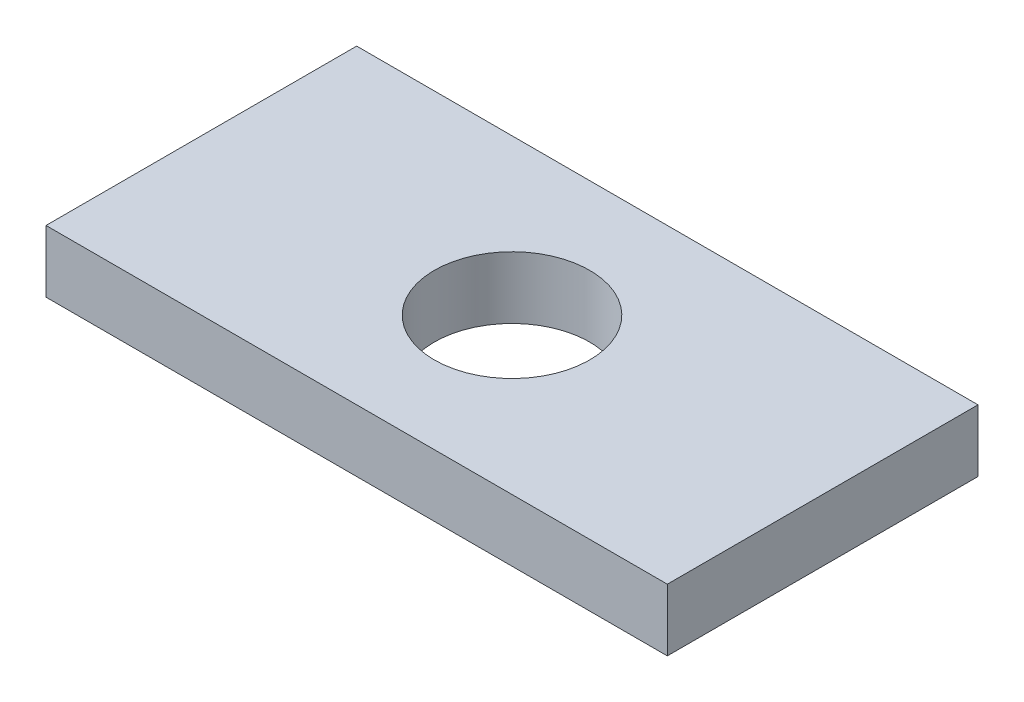
ISO-10303-21;
HEADER;
FILE_DESCRIPTION(('STEP AP214'),'2;1');
FILE_NAME('part.step','',(''),(''),'','','');
FILE_SCHEMA(('AUTOMOTIVE_DESIGN { 1 0 10303 214 1 1 1 1 }'));
ENDSEC;
DATA;
#1=APPLICATION_CONTEXT('core data for automotive mechanical design processes');
#2=APPLICATION_PROTOCOL_DEFINITION('international standard','automotive_design',2000,#1);
#3=PRODUCT_CONTEXT('',#1,'mechanical');
#4=PRODUCT('Part','Part','',(#3));
#5=PRODUCT_RELATED_PRODUCT_CATEGORY('part','',(#4));
#6=PRODUCT_DEFINITION_FORMATION('','',#4);
#7=PRODUCT_DEFINITION_CONTEXT('part definition',#1,'design');
#8=PRODUCT_DEFINITION('design','',#6,#7);
#9=PRODUCT_DEFINITION_SHAPE('','',#8);
#10=(LENGTH_UNIT() NAMED_UNIT(*) SI_UNIT(.MILLI.,.METRE.));
#11=(NAMED_UNIT(*) PLANE_ANGLE_UNIT() SI_UNIT($,.RADIAN.));
#12=(NAMED_UNIT(*) SI_UNIT($,.STERADIAN.) SOLID_ANGLE_UNIT());
#13=UNCERTAINTY_MEASURE_WITH_UNIT(LENGTH_MEASURE(1.E-05),#10,'distance_accuracy_value','');
#14=(GEOMETRIC_REPRESENTATION_CONTEXT(3) GLOBAL_UNCERTAINTY_ASSIGNED_CONTEXT((#13)) GLOBAL_UNIT_ASSIGNED_CONTEXT((#10,
#11,#12)) REPRESENTATION_CONTEXT('',''));
#15=CARTESIAN_POINT('',(0.,0.,0.));
#16=DIRECTION('',(0.,0.,1.));
#17=DIRECTION('',(1.,0.,0.));
#18=AXIS2_PLACEMENT_3D('',#15,#16,#17);
#19=CARTESIAN_POINT('',(0.,4.,0.));
#20=DIRECTION('',(1.,0.,0.));
#21=DIRECTION('',(0.,0.,-1.));
#22=AXIS2_PLACEMENT_3D('',#19,#20,#21);
#23=PLANE('',#22);
#24=DIRECTION('',(0.,0.,1.));
#25=VECTOR('',#24,1.);
#26=CARTESIAN_POINT('',(0.,0.,0.));
#27=LINE('',#26,#25);
#28=CARTESIAN_POINT('',(0.,0.,-20.));
#29=VERTEX_POINT('',#28);
#30=CARTESIAN_POINT('',(0.,0.,0.));
#31=VERTEX_POINT('',#30);
#32=EDGE_CURVE('E97',#29,#31,#27,.T.);
#33=ORIENTED_EDGE('',*,*,#32,.T.);
#34=DIRECTION('',(0.,-1.,0.));
#35=VECTOR('',#34,1.);
#36=CARTESIAN_POINT('',(0.,4.,0.));
#37=LINE('',#36,#35);
#38=CARTESIAN_POINT('',(0.,4.,0.));
#39=VERTEX_POINT('',#38);
#40=EDGE_CURVE('E11',#39,#31,#37,.T.);
#41=ORIENTED_EDGE('',*,*,#40,.F.);
#42=DIRECTION('',(0.,0.,1.));
#43=VECTOR('',#42,1.);
#44=CARTESIAN_POINT('',(0.,4.,0.));
#45=LINE('',#44,#43);
#46=CARTESIAN_POINT('',(0.,4.,-20.));
#47=VERTEX_POINT('',#46);
#48=EDGE_CURVE('E85',#47,#39,#45,.T.);
#49=ORIENTED_EDGE('',*,*,#48,.F.);
#50=DIRECTION('',(0.,-1.,0.));
#51=VECTOR('',#50,1.);
#52=CARTESIAN_POINT('',(0.,4.,-20.));
#53=LINE('',#52,#51);
#54=EDGE_CURVE('E93',#47,#29,#53,.T.);
#55=ORIENTED_EDGE('',*,*,#54,.T.);
#56=EDGE_LOOP('',(#33,#41,#49,#55));
#57=FACE_BOUND('',#56,.T.);
#58=ADVANCED_FACE('F34',(#57),#23,.F.);
#59=CARTESIAN_POINT('',(0.,4.,0.));
#60=DIRECTION('',(0.,0.,-1.));
#61=DIRECTION('',(-1.,0.,0.));
#62=AXIS2_PLACEMENT_3D('',#59,#60,#61);
#63=PLANE('',#62);
#64=DIRECTION('',(1.,0.,0.));
#65=VECTOR('',#64,1.);
#66=CARTESIAN_POINT('',(0.,0.,0.));
#67=LINE('',#66,#65);
#68=CARTESIAN_POINT('',(40.,0.,0.));
#69=VERTEX_POINT('',#68);
#70=EDGE_CURVE('E89',#31,#69,#67,.T.);
#71=ORIENTED_EDGE('',*,*,#70,.T.);
#72=DIRECTION('',(0.,-1.,0.));
#73=VECTOR('',#72,1.);
#74=CARTESIAN_POINT('',(40.,4.,0.));
#75=LINE('',#74,#73);
#76=CARTESIAN_POINT('',(40.,4.,0.));
#77=VERTEX_POINT('',#76);
#78=EDGE_CURVE('E42',#77,#69,#75,.T.);
#79=ORIENTED_EDGE('',*,*,#78,.F.);
#80=DIRECTION('',(1.,0.,0.));
#81=VECTOR('',#80,1.);
#82=CARTESIAN_POINT('',(0.,4.,0.));
#83=LINE('',#82,#81);
#84=EDGE_CURVE('E80',#39,#77,#83,.T.);
#85=ORIENTED_EDGE('',*,*,#84,.F.);
#86=ORIENTED_EDGE('',*,*,#40,.T.);
#87=EDGE_LOOP('',(#71,#79,#85,#86));
#88=FACE_BOUND('',#87,.T.);
#89=ADVANCED_FACE('F88',(#88),#63,.F.);
#90=CARTESIAN_POINT('',(40.,4.,0.));
#91=DIRECTION('',(-1.,0.,0.));
#92=DIRECTION('',(0.,0.,1.));
#93=AXIS2_PLACEMENT_3D('',#90,#91,#92);
#94=PLANE('',#93);
#95=DIRECTION('',(0.,0.,-1.));
#96=VECTOR('',#95,1.);
#97=CARTESIAN_POINT('',(40.,0.,0.));
#98=LINE('',#97,#96);
#99=CARTESIAN_POINT('',(40.,0.,-20.));
#100=VERTEX_POINT('',#99);
#101=EDGE_CURVE('E67',#69,#100,#98,.T.);
#102=ORIENTED_EDGE('',*,*,#101,.T.);
#103=DIRECTION('',(0.,-1.,0.));
#104=VECTOR('',#103,1.);
#105=CARTESIAN_POINT('',(40.,4.,-20.));
#106=LINE('',#105,#104);
#107=CARTESIAN_POINT('',(40.,4.,-20.));
#108=VERTEX_POINT('',#107);
#109=EDGE_CURVE('E90',#108,#100,#106,.T.);
#110=ORIENTED_EDGE('',*,*,#109,.F.);
#111=DIRECTION('',(0.,0.,-1.));
#112=VECTOR('',#111,1.);
#113=CARTESIAN_POINT('',(40.,4.,0.));
#114=LINE('',#113,#112);
#115=EDGE_CURVE('E83',#77,#108,#114,.T.);
#116=ORIENTED_EDGE('',*,*,#115,.F.);
#117=ORIENTED_EDGE('',*,*,#78,.T.);
#118=EDGE_LOOP('',(#102,#110,#116,#117));
#119=FACE_BOUND('',#118,.T.);
#120=ADVANCED_FACE('F91',(#119),#94,.F.);
#121=CARTESIAN_POINT('',(0.,4.,-20.));
#122=DIRECTION('',(0.,0.,1.));
#123=DIRECTION('',(1.,0.,0.));
#124=AXIS2_PLACEMENT_3D('',#121,#122,#123);
#125=PLANE('',#124);
#126=DIRECTION('',(-1.,0.,0.));
#127=VECTOR('',#126,1.);
#128=CARTESIAN_POINT('',(0.,0.,-20.));
#129=LINE('',#128,#127);
#130=EDGE_CURVE('E73',#100,#29,#129,.T.);
#131=ORIENTED_EDGE('',*,*,#130,.T.);
#132=ORIENTED_EDGE('',*,*,#54,.F.);
#133=DIRECTION('',(-1.,0.,0.));
#134=VECTOR('',#133,1.);
#135=CARTESIAN_POINT('',(0.,4.,-20.));
#136=LINE('',#135,#134);
#137=EDGE_CURVE('E50',#108,#47,#136,.T.);
#138=ORIENTED_EDGE('',*,*,#137,.F.);
#139=ORIENTED_EDGE('',*,*,#109,.T.);
#140=EDGE_LOOP('',(#131,#132,#138,#139));
#141=FACE_BOUND('',#140,.T.);
#142=ADVANCED_FACE('F105',(#141),#125,.F.);
#143=CARTESIAN_POINT('',(0.,4.,0.));
#144=DIRECTION('',(0.,-1.,0.));
#145=DIRECTION('',(0.,0.,-1.));
#146=AXIS2_PLACEMENT_3D('',#143,#144,#145);
#147=PLANE('',#146);
#148=CARTESIAN_POINT('',(20.,4.,-10.));
#149=DIRECTION('',(0.,1.,0.));
#150=DIRECTION('',(0.,0.,1.));
#151=AXIS2_PLACEMENT_3D('',#148,#149,#150);
#152=CIRCLE('',#151,5.);
#153=CARTESIAN_POINT('',(20.,4.,-5.));
#154=VERTEX_POINT('',#153);
#155=EDGE_CURVE('E111',#154,#154,#152,.T.);
#156=ORIENTED_EDGE('',*,*,#155,.F.);
#157=EDGE_LOOP('',(#156));
#158=FACE_BOUND('',#157,.T.);
#159=ORIENTED_EDGE('',*,*,#48,.T.);
#160=ORIENTED_EDGE('',*,*,#84,.T.);
#161=ORIENTED_EDGE('',*,*,#115,.T.);
#162=ORIENTED_EDGE('',*,*,#137,.T.);
#163=EDGE_LOOP('',(#159,#160,#161,#162));
#164=FACE_BOUND('',#163,.T.);
#165=ADVANCED_FACE('F81',(#158,#164),#147,.F.);
#166=CARTESIAN_POINT('',(0.,0.,0.));
#167=DIRECTION('',(0.,-1.,0.));
#168=DIRECTION('',(0.,0.,-1.));
#169=AXIS2_PLACEMENT_3D('',#166,#167,#168);
#170=PLANE('',#169);
#171=CARTESIAN_POINT('',(20.,0.,-10.));
#172=DIRECTION('',(0.,1.,0.));
#173=DIRECTION('',(0.,0.,1.));
#174=AXIS2_PLACEMENT_3D('',#171,#172,#173);
#175=CIRCLE('',#174,5.);
#176=CARTESIAN_POINT('',(20.,0.,-5.));
#177=VERTEX_POINT('',#176);
#178=EDGE_CURVE('E100',#177,#177,#175,.T.);
#179=ORIENTED_EDGE('',*,*,#178,.T.);
#180=EDGE_LOOP('',(#179));
#181=FACE_BOUND('',#180,.T.);
#182=ORIENTED_EDGE('',*,*,#32,.F.);
#183=ORIENTED_EDGE('',*,*,#130,.F.);
#184=ORIENTED_EDGE('',*,*,#101,.F.);
#185=ORIENTED_EDGE('',*,*,#70,.F.);
#186=EDGE_LOOP('',(#182,#183,#184,#185));
#187=FACE_BOUND('',#186,.T.);
#188=ADVANCED_FACE('F108',(#181,#187),#170,.T.);
#189=CARTESIAN_POINT('',(20.,0.,-10.));
#190=DIRECTION('',(0.,1.,0.));
#191=DIRECTION('',(0.,0.,1.));
#192=AXIS2_PLACEMENT_3D('',#189,#190,#191);
#193=CYLINDRICAL_SURFACE('',#192,5.);
#194=ORIENTED_EDGE('',*,*,#178,.F.);
#195=EDGE_LOOP('',(#194));
#196=FACE_BOUND('',#195,.T.);
#197=ORIENTED_EDGE('',*,*,#155,.T.);
#198=EDGE_LOOP('',(#197));
#199=FACE_BOUND('',#198,.T.);
#200=ADVANCED_FACE('F118',(#196,#199),#193,.F.);
#201=CLOSED_SHELL('',(#58,#89,#120,#142,#165,#188,#200));
#202=MANIFOLD_SOLID_BREP('B2',#201);
#203=ADVANCED_BREP_SHAPE_REPRESENTATION('',(#18,#202),#14);
#204=SHAPE_DEFINITION_REPRESENTATION(#9,#203);
ENDSEC;
END-ISO-10303-21;
